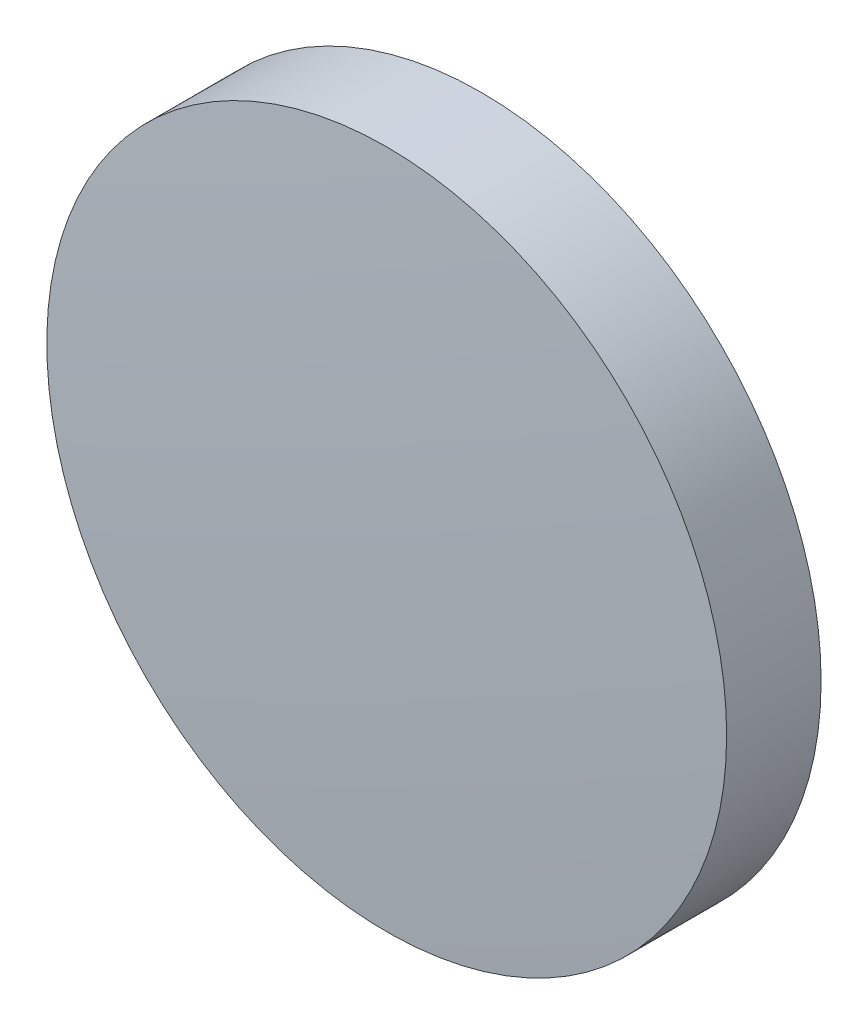
ISO-10303-21;
HEADER;
FILE_DESCRIPTION(('STEP AP214'),'2;1');
FILE_NAME('part.step','',(''),(''),'','','');
FILE_SCHEMA(('AUTOMOTIVE_DESIGN { 1 0 10303 214 1 1 1 1 }'));
ENDSEC;
DATA;
#1=APPLICATION_CONTEXT('core data for automotive mechanical design processes');
#2=APPLICATION_PROTOCOL_DEFINITION('international standard','automotive_design',2000,#1);
#3=PRODUCT_CONTEXT('',#1,'mechanical');
#4=PRODUCT('Part','Part','',(#3));
#5=PRODUCT_RELATED_PRODUCT_CATEGORY('part','',(#4));
#6=PRODUCT_DEFINITION_FORMATION('','',#4);
#7=PRODUCT_DEFINITION_CONTEXT('part definition',#1,'design');
#8=PRODUCT_DEFINITION('design','',#6,#7);
#9=PRODUCT_DEFINITION_SHAPE('','',#8);
#10=(LENGTH_UNIT() NAMED_UNIT(*) SI_UNIT(.MILLI.,.METRE.));
#11=(NAMED_UNIT(*) PLANE_ANGLE_UNIT() SI_UNIT($,.RADIAN.));
#12=(NAMED_UNIT(*) SI_UNIT($,.STERADIAN.) SOLID_ANGLE_UNIT());
#13=UNCERTAINTY_MEASURE_WITH_UNIT(LENGTH_MEASURE(1.E-05),#10,'distance_accuracy_value','');
#14=(GEOMETRIC_REPRESENTATION_CONTEXT(3) GLOBAL_UNCERTAINTY_ASSIGNED_CONTEXT((#13)) GLOBAL_UNIT_ASSIGNED_CONTEXT((#10,
#11,#12)) REPRESENTATION_CONTEXT('',''));
#15=CARTESIAN_POINT('',(0.,0.,0.));
#16=DIRECTION('',(0.,0.,1.));
#17=DIRECTION('',(1.,0.,0.));
#18=AXIS2_PLACEMENT_3D('',#15,#16,#17);
#19=CARTESIAN_POINT('',(0.,0.,-248.074136688465));
#20=DIRECTION('',(0.,0.,1.));
#21=DIRECTION('',(0.,1.,0.));
#22=AXIS2_PLACEMENT_3D('',#19,#20,#21);
#23=SPHERICAL_SURFACE('',#22,250.);
#24=CARTESIAN_POINT('',(0.,0.,1.60307492685259));
#25=DIRECTION('',(0.,0.,1.));
#26=DIRECTION('',(1.,0.,0.));
#27=AXIS2_PLACEMENT_3D('',#24,#25,#26);
#28=CIRCLE('',#27,12.7);
#29=CARTESIAN_POINT('',(12.7,0.,1.60307492685259));
#30=VERTEX_POINT('',#29);
#31=EDGE_CURVE('E8',#30,#30,#28,.T.);
#32=ORIENTED_EDGE('',*,*,#31,.T.);
#33=EDGE_LOOP('',(#32));
#34=FACE_BOUND('',#33,.T.);
#35=ADVANCED_FACE('F12',(#34),#23,.T.);
#36=CARTESIAN_POINT('',(0.,0.,9.33096706637624));
#37=DIRECTION('',(0.,0.,1.));
#38=DIRECTION('',(1.,0.,0.));
#39=AXIS2_PLACEMENT_3D('',#36,#37,#38);
#40=CYLINDRICAL_SURFACE('',#39,12.7);
#41=ORIENTED_EDGE('',*,*,#31,.F.);
#42=EDGE_LOOP('',(#41));
#43=FACE_BOUND('',#42,.T.);
#44=CARTESIAN_POINT('',(0.,0.,-1.92586331153519));
#45=DIRECTION('',(0.,0.,1.));
#46=DIRECTION('',(1.,0.,0.));
#47=AXIS2_PLACEMENT_3D('',#44,#45,#46);
#48=CIRCLE('',#47,12.7);
#49=CARTESIAN_POINT('',(12.7,0.,-1.92586331153519));
#50=VERTEX_POINT('',#49);
#51=EDGE_CURVE('E18',#50,#50,#48,.T.);
#52=ORIENTED_EDGE('',*,*,#51,.T.);
#53=EDGE_LOOP('',(#52));
#54=FACE_BOUND('',#53,.T.);
#55=ADVANCED_FACE('F24',(#43,#54),#40,.T.);
#56=CARTESIAN_POINT('',(0.,0.,-96.1841366884648));
#57=DIRECTION('',(0.,0.,1.));
#58=DIRECTION('',(0.,1.,0.));
#59=AXIS2_PLACEMENT_3D('',#56,#57,#58);
#60=SPHERICAL_SURFACE('',#59,95.11);
#61=ORIENTED_EDGE('',*,*,#51,.F.);
#62=EDGE_LOOP('',(#61));
#63=FACE_BOUND('',#62,.T.);
#64=ADVANCED_FACE('F26',(#63),#60,.F.);
#65=CLOSED_SHELL('',(#35,#55,#64));
#66=MANIFOLD_SOLID_BREP('B1',#65);
#67=ADVANCED_BREP_SHAPE_REPRESENTATION('',(#18,#66),#14);
#68=SHAPE_DEFINITION_REPRESENTATION(#9,#67);
ENDSEC;
END-ISO-10303-21;
